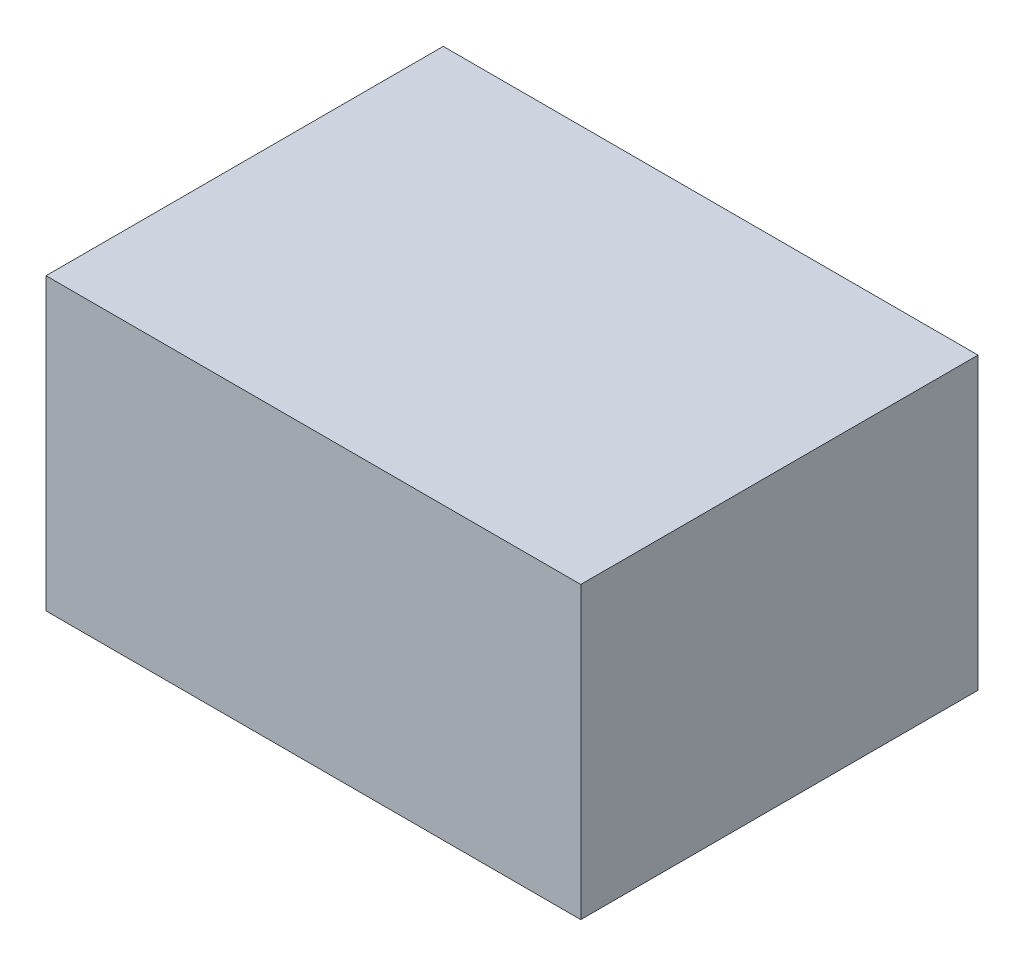
ISO-10303-21;
HEADER;
FILE_DESCRIPTION(('STEP AP214'),'2;1');
FILE_NAME('part.step','',(''),(''),'','','');
FILE_SCHEMA(('AUTOMOTIVE_DESIGN { 1 0 10303 214 1 1 1 1 }'));
ENDSEC;
DATA;
#1=APPLICATION_CONTEXT('core data for automotive mechanical design processes');
#2=APPLICATION_PROTOCOL_DEFINITION('international standard','automotive_design',2000,#1);
#3=PRODUCT_CONTEXT('',#1,'mechanical');
#4=PRODUCT('Part','Part','',(#3));
#5=PRODUCT_RELATED_PRODUCT_CATEGORY('part','',(#4));
#6=PRODUCT_DEFINITION_FORMATION('','',#4);
#7=PRODUCT_DEFINITION_CONTEXT('part definition',#1,'design');
#8=PRODUCT_DEFINITION('design','',#6,#7);
#9=PRODUCT_DEFINITION_SHAPE('','',#8);
#10=(LENGTH_UNIT() NAMED_UNIT(*) SI_UNIT(.MILLI.,.METRE.));
#11=(NAMED_UNIT(*) PLANE_ANGLE_UNIT() SI_UNIT($,.RADIAN.));
#12=(NAMED_UNIT(*) SI_UNIT($,.STERADIAN.) SOLID_ANGLE_UNIT());
#13=UNCERTAINTY_MEASURE_WITH_UNIT(LENGTH_MEASURE(1.E-05),#10,'distance_accuracy_value','');
#14=(GEOMETRIC_REPRESENTATION_CONTEXT(3) GLOBAL_UNCERTAINTY_ASSIGNED_CONTEXT((#13)) GLOBAL_UNIT_ASSIGNED_CONTEXT((#10,
#11,#12)) REPRESENTATION_CONTEXT('',''));
#15=CARTESIAN_POINT('',(0.,0.,0.));
#16=DIRECTION('',(0.,0.,1.));
#17=DIRECTION('',(1.,0.,0.));
#18=AXIS2_PLACEMENT_3D('',#15,#16,#17);
#19=CARTESIAN_POINT('',(-0.87499952,0.47500032,1.29999994));
#20=DIRECTION('',(-1.,0.,0.));
#21=DIRECTION('',(0.,0.,1.));
#22=AXIS2_PLACEMENT_3D('',#19,#20,#21);
#23=PLANE('',#22);
#24=DIRECTION('',(0.,0.,-1.));
#25=VECTOR('',#24,1.);
#26=CARTESIAN_POINT('',(-0.87499952,-0.47500032,1.29999994));
#27=LINE('',#26,#25);
#28=CARTESIAN_POINT('',(-0.87499952,-0.47500032,1.29999994));
#29=VERTEX_POINT('',#28);
#30=CARTESIAN_POINT('',(-0.87499952,-0.47500032,0.));
#31=VERTEX_POINT('',#30);
#32=EDGE_CURVE('E97',#29,#31,#27,.T.);
#33=ORIENTED_EDGE('',*,*,#32,.F.);
#34=DIRECTION('',(0.,-1.,0.));
#35=VECTOR('',#34,1.);
#36=CARTESIAN_POINT('',(-0.87499952,0.47500032,1.29999994));
#37=LINE('',#36,#35);
#38=CARTESIAN_POINT('',(-0.87499952,0.47500032,1.29999994));
#39=VERTEX_POINT('',#38);
#40=EDGE_CURVE('E11',#39,#29,#37,.T.);
#41=ORIENTED_EDGE('',*,*,#40,.F.);
#42=DIRECTION('',(0.,0.,-1.));
#43=VECTOR('',#42,1.);
#44=CARTESIAN_POINT('',(-0.87499952,0.47500032,1.29999994));
#45=LINE('',#44,#43);
#46=CARTESIAN_POINT('',(-0.87499952,0.47500032,0.));
#47=VERTEX_POINT('',#46);
#48=EDGE_CURVE('E91',#39,#47,#45,.T.);
#49=ORIENTED_EDGE('',*,*,#48,.T.);
#50=DIRECTION('',(0.,-1.,0.));
#51=VECTOR('',#50,1.);
#52=CARTESIAN_POINT('',(-0.87499952,0.47500032,0.));
#53=LINE('',#52,#51);
#54=EDGE_CURVE('E36',#47,#31,#53,.T.);
#55=ORIENTED_EDGE('',*,*,#54,.T.);
#56=EDGE_LOOP('',(#33,#41,#49,#55));
#57=FACE_BOUND('',#56,.T.);
#58=ADVANCED_FACE('F33',(#57),#23,.T.);
#59=CARTESIAN_POINT('',(0.87499952,0.47500032,1.29999994));
#60=DIRECTION('',(0.,0.,1.));
#61=DIRECTION('',(1.,0.,0.));
#62=AXIS2_PLACEMENT_3D('',#59,#60,#61);
#63=PLANE('',#62);
#64=DIRECTION('',(-1.,0.,0.));
#65=VECTOR('',#64,1.);
#66=CARTESIAN_POINT('',(0.87499952,-0.47500032,1.29999994));
#67=LINE('',#66,#65);
#68=CARTESIAN_POINT('',(0.87499952,-0.47500032,1.29999994));
#69=VERTEX_POINT('',#68);
#70=EDGE_CURVE('E93',#69,#29,#67,.T.);
#71=ORIENTED_EDGE('',*,*,#70,.F.);
#72=DIRECTION('',(0.,-1.,0.));
#73=VECTOR('',#72,1.);
#74=CARTESIAN_POINT('',(0.87499952,0.47500032,1.29999994));
#75=LINE('',#74,#73);
#76=CARTESIAN_POINT('',(0.87499952,0.47500032,1.29999994));
#77=VERTEX_POINT('',#76);
#78=EDGE_CURVE('E42',#77,#69,#75,.T.);
#79=ORIENTED_EDGE('',*,*,#78,.F.);
#80=DIRECTION('',(-1.,0.,0.));
#81=VECTOR('',#80,1.);
#82=CARTESIAN_POINT('',(0.87499952,0.47500032,1.29999994));
#83=LINE('',#82,#81);
#84=EDGE_CURVE('E88',#77,#39,#83,.T.);
#85=ORIENTED_EDGE('',*,*,#84,.T.);
#86=ORIENTED_EDGE('',*,*,#40,.T.);
#87=EDGE_LOOP('',(#71,#79,#85,#86));
#88=FACE_BOUND('',#87,.T.);
#89=ADVANCED_FACE('F107',(#88),#63,.T.);
#90=CARTESIAN_POINT('',(0.87499952,0.47500032,0.));
#91=DIRECTION('',(1.,0.,0.));
#92=DIRECTION('',(0.,0.,-1.));
#93=AXIS2_PLACEMENT_3D('',#90,#91,#92);
#94=PLANE('',#93);
#95=DIRECTION('',(0.,0.,1.));
#96=VECTOR('',#95,1.);
#97=CARTESIAN_POINT('',(0.87499952,-0.47500032,0.));
#98=LINE('',#97,#96);
#99=CARTESIAN_POINT('',(0.87499952,-0.47500032,0.));
#100=VERTEX_POINT('',#99);
#101=EDGE_CURVE('E83',#100,#69,#98,.T.);
#102=ORIENTED_EDGE('',*,*,#101,.F.);
#103=DIRECTION('',(0.,-1.,0.));
#104=VECTOR('',#103,1.);
#105=CARTESIAN_POINT('',(0.87499952,0.47500032,0.));
#106=LINE('',#105,#104);
#107=CARTESIAN_POINT('',(0.87499952,0.47500032,0.));
#108=VERTEX_POINT('',#107);
#109=EDGE_CURVE('E78',#108,#100,#106,.T.);
#110=ORIENTED_EDGE('',*,*,#109,.F.);
#111=DIRECTION('',(0.,0.,1.));
#112=VECTOR('',#111,1.);
#113=CARTESIAN_POINT('',(0.87499952,0.47500032,0.));
#114=LINE('',#113,#112);
#115=EDGE_CURVE('E81',#108,#77,#114,.T.);
#116=ORIENTED_EDGE('',*,*,#115,.T.);
#117=ORIENTED_EDGE('',*,*,#78,.T.);
#118=EDGE_LOOP('',(#102,#110,#116,#117));
#119=FACE_BOUND('',#118,.T.);
#120=ADVANCED_FACE('F80',(#119),#94,.T.);
#121=CARTESIAN_POINT('',(-0.87499952,0.47500032,0.));
#122=DIRECTION('',(0.,0.,-1.));
#123=DIRECTION('',(-1.,0.,0.));
#124=AXIS2_PLACEMENT_3D('',#121,#122,#123);
#125=PLANE('',#124);
#126=DIRECTION('',(1.,0.,0.));
#127=VECTOR('',#126,1.);
#128=CARTESIAN_POINT('',(-0.87499952,-0.47500032,0.));
#129=LINE('',#128,#127);
#130=EDGE_CURVE('E100',#31,#100,#129,.T.);
#131=ORIENTED_EDGE('',*,*,#130,.F.);
#132=ORIENTED_EDGE('',*,*,#54,.F.);
#133=DIRECTION('',(1.,0.,0.));
#134=VECTOR('',#133,1.);
#135=CARTESIAN_POINT('',(-0.87499952,0.47500032,0.));
#136=LINE('',#135,#134);
#137=EDGE_CURVE('E87',#47,#108,#136,.T.);
#138=ORIENTED_EDGE('',*,*,#137,.T.);
#139=ORIENTED_EDGE('',*,*,#109,.T.);
#140=EDGE_LOOP('',(#131,#132,#138,#139));
#141=FACE_BOUND('',#140,.T.);
#142=ADVANCED_FACE('F90',(#141),#125,.T.);
#143=CARTESIAN_POINT('',(0.,0.47500032,0.));
#144=DIRECTION('',(0.,-1.,0.));
#145=DIRECTION('',(0.,0.,-1.));
#146=AXIS2_PLACEMENT_3D('',#143,#144,#145);
#147=PLANE('',#146);
#148=ORIENTED_EDGE('',*,*,#48,.F.);
#149=ORIENTED_EDGE('',*,*,#84,.F.);
#150=ORIENTED_EDGE('',*,*,#115,.F.);
#151=ORIENTED_EDGE('',*,*,#137,.F.);
#152=EDGE_LOOP('',(#148,#149,#150,#151));
#153=FACE_BOUND('',#152,.T.);
#154=ADVANCED_FACE('F86',(#153),#147,.F.);
#155=CARTESIAN_POINT('',(0.,-0.47500032,0.));
#156=DIRECTION('',(0.,-1.,0.));
#157=DIRECTION('',(0.,0.,-1.));
#158=AXIS2_PLACEMENT_3D('',#155,#156,#157);
#159=PLANE('',#158);
#160=ORIENTED_EDGE('',*,*,#32,.T.);
#161=ORIENTED_EDGE('',*,*,#130,.T.);
#162=ORIENTED_EDGE('',*,*,#101,.T.);
#163=ORIENTED_EDGE('',*,*,#70,.T.);
#164=EDGE_LOOP('',(#160,#161,#162,#163));
#165=FACE_BOUND('',#164,.T.);
#166=ADVANCED_FACE('F106',(#165),#159,.T.);
#167=CLOSED_SHELL('',(#58,#89,#120,#142,#154,#166));
#168=MANIFOLD_SOLID_BREP('B2',#167);
#169=ADVANCED_BREP_SHAPE_REPRESENTATION('',(#18,#168),#14);
#170=SHAPE_DEFINITION_REPRESENTATION(#9,#169);
ENDSEC;
END-ISO-10303-21;
